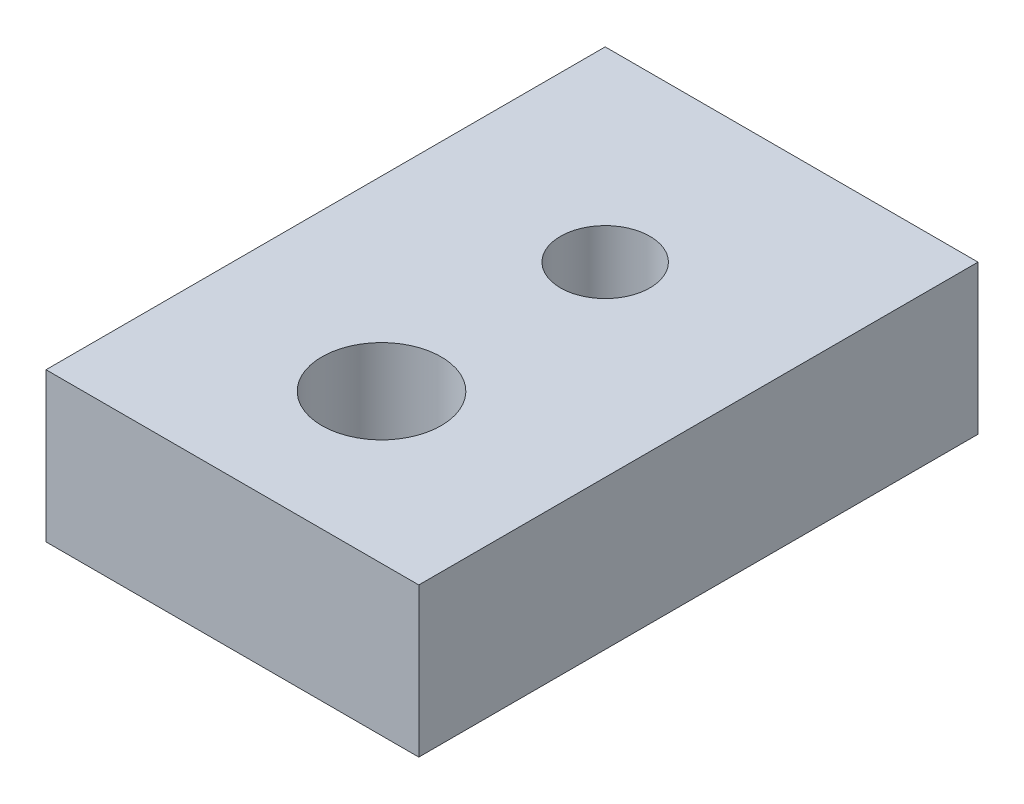
ISO-10303-21;
HEADER;
FILE_DESCRIPTION(('STEP AP214'),'2;1');
FILE_NAME('part.step','',(''),(''),'','','');
FILE_SCHEMA(('AUTOMOTIVE_DESIGN { 1 0 10303 214 1 1 1 1 }'));
ENDSEC;
DATA;
#1=APPLICATION_CONTEXT('core data for automotive mechanical design processes');
#2=APPLICATION_PROTOCOL_DEFINITION('international standard','automotive_design',2000,#1);
#3=PRODUCT_CONTEXT('',#1,'mechanical');
#4=PRODUCT('Part','Part','',(#3));
#5=PRODUCT_RELATED_PRODUCT_CATEGORY('part','',(#4));
#6=PRODUCT_DEFINITION_FORMATION('','',#4);
#7=PRODUCT_DEFINITION_CONTEXT('part definition',#1,'design');
#8=PRODUCT_DEFINITION('design','',#6,#7);
#9=PRODUCT_DEFINITION_SHAPE('','',#8);
#10=(LENGTH_UNIT() NAMED_UNIT(*) SI_UNIT(.MILLI.,.METRE.));
#11=(NAMED_UNIT(*) PLANE_ANGLE_UNIT() SI_UNIT($,.RADIAN.));
#12=(NAMED_UNIT(*) SI_UNIT($,.STERADIAN.) SOLID_ANGLE_UNIT());
#13=UNCERTAINTY_MEASURE_WITH_UNIT(LENGTH_MEASURE(1.E-05),#10,'distance_accuracy_value','');
#14=(GEOMETRIC_REPRESENTATION_CONTEXT(3) GLOBAL_UNCERTAINTY_ASSIGNED_CONTEXT((#13)) GLOBAL_UNIT_ASSIGNED_CONTEXT((#10,
#11,#12)) REPRESENTATION_CONTEXT('',''));
#15=CARTESIAN_POINT('',(0.,0.,0.));
#16=DIRECTION('',(0.,0.,1.));
#17=DIRECTION('',(1.,0.,0.));
#18=AXIS2_PLACEMENT_3D('',#15,#16,#17);
#19=CARTESIAN_POINT('',(0.,20.,0.));
#20=DIRECTION('',(0.,1.,0.));
#21=DIRECTION('',(0.,0.,1.));
#22=AXIS2_PLACEMENT_3D('',#19,#20,#21);
#23=PLANE('',#22);
#24=CARTESIAN_POINT('',(0.,20.,0.));
#25=DIRECTION('',(0.,1.,0.));
#26=DIRECTION('',(0.,0.,1.));
#27=AXIS2_PLACEMENT_3D('',#24,#25,#26);
#28=CIRCLE('',#27,6.);
#29=CARTESIAN_POINT('',(0.,20.,6.));
#30=VERTEX_POINT('',#29);
#31=EDGE_CURVE('E100',#30,#30,#28,.T.);
#32=ORIENTED_EDGE('',*,*,#31,.F.);
#33=EDGE_LOOP('',(#32));
#34=FACE_BOUND('',#33,.T.);
#35=DIRECTION('',(0.,0.,1.));
#36=VECTOR('',#35,1.);
#37=CARTESIAN_POINT('',(-25.,20.,-25.));
#38=LINE('',#37,#36);
#39=CARTESIAN_POINT('',(-25.,20.,-25.));
#40=VERTEX_POINT('',#39);
#41=CARTESIAN_POINT('',(-25.,20.,50.));
#42=VERTEX_POINT('',#41);
#43=EDGE_CURVE('E85',#40,#42,#38,.T.);
#44=ORIENTED_EDGE('',*,*,#43,.T.);
#45=DIRECTION('',(1.,0.,0.));
#46=VECTOR('',#45,1.);
#47=CARTESIAN_POINT('',(-25.,20.,50.));
#48=LINE('',#47,#46);
#49=CARTESIAN_POINT('',(25.,20.,50.));
#50=VERTEX_POINT('',#49);
#51=EDGE_CURVE('E80',#42,#50,#48,.T.);
#52=ORIENTED_EDGE('',*,*,#51,.T.);
#53=DIRECTION('',(0.,0.,-1.));
#54=VECTOR('',#53,1.);
#55=CARTESIAN_POINT('',(25.,20.,-25.));
#56=LINE('',#55,#54);
#57=CARTESIAN_POINT('',(25.,20.,-25.));
#58=VERTEX_POINT('',#57);
#59=EDGE_CURVE('E83',#50,#58,#56,.T.);
#60=ORIENTED_EDGE('',*,*,#59,.T.);
#61=DIRECTION('',(-1.,0.,0.));
#62=VECTOR('',#61,1.);
#63=CARTESIAN_POINT('',(-25.,20.,-25.));
#64=LINE('',#63,#62);
#65=EDGE_CURVE('E50',#58,#40,#64,.T.);
#66=ORIENTED_EDGE('',*,*,#65,.T.);
#67=EDGE_LOOP('',(#44,#52,#60,#66));
#68=FACE_BOUND('',#67,.T.);
#69=CARTESIAN_POINT('',(0.,20.,30.));
#70=DIRECTION('',(0.,1.,0.));
#71=DIRECTION('',(0.,0.,1.));
#72=AXIS2_PLACEMENT_3D('',#69,#70,#71);
#73=CIRCLE('',#72,8.);
#74=CARTESIAN_POINT('',(0.,20.,38.));
#75=VERTEX_POINT('',#74);
#76=EDGE_CURVE('E115',#75,#75,#73,.T.);
#77=ORIENTED_EDGE('',*,*,#76,.F.);
#78=EDGE_LOOP('',(#77));
#79=FACE_BOUND('',#78,.T.);
#80=ADVANCED_FACE('F33',(#34,#68,#79),#23,.T.);
#81=CARTESIAN_POINT('',(0.,0.,0.));
#82=DIRECTION('',(0.,1.,0.));
#83=DIRECTION('',(0.,0.,1.));
#84=AXIS2_PLACEMENT_3D('',#81,#82,#83);
#85=PLANE('',#84);
#86=DIRECTION('',(0.,0.,1.));
#87=VECTOR('',#86,1.);
#88=CARTESIAN_POINT('',(-25.,0.,-25.));
#89=LINE('',#88,#87);
#90=CARTESIAN_POINT('',(-25.,0.,-25.));
#91=VERTEX_POINT('',#90);
#92=CARTESIAN_POINT('',(-25.,0.,50.));
#93=VERTEX_POINT('',#92);
#94=EDGE_CURVE('E97',#91,#93,#89,.T.);
#95=ORIENTED_EDGE('',*,*,#94,.F.);
#96=DIRECTION('',(-1.,0.,0.));
#97=VECTOR('',#96,1.);
#98=CARTESIAN_POINT('',(-25.,0.,-25.));
#99=LINE('',#98,#97);
#100=CARTESIAN_POINT('',(25.,0.,-25.));
#101=VERTEX_POINT('',#100);
#102=EDGE_CURVE('E73',#101,#91,#99,.T.);
#103=ORIENTED_EDGE('',*,*,#102,.F.);
#104=DIRECTION('',(0.,0.,-1.));
#105=VECTOR('',#104,1.);
#106=CARTESIAN_POINT('',(25.,0.,-25.));
#107=LINE('',#106,#105);
#108=CARTESIAN_POINT('',(25.,0.,50.));
#109=VERTEX_POINT('',#108);
#110=EDGE_CURVE('E67',#109,#101,#107,.T.);
#111=ORIENTED_EDGE('',*,*,#110,.F.);
#112=DIRECTION('',(1.,0.,0.));
#113=VECTOR('',#112,1.);
#114=CARTESIAN_POINT('',(-25.,0.,50.));
#115=LINE('',#114,#113);
#116=EDGE_CURVE('E89',#93,#109,#115,.T.);
#117=ORIENTED_EDGE('',*,*,#116,.F.);
#118=EDGE_LOOP('',(#95,#103,#111,#117));
#119=FACE_BOUND('',#118,.T.);
#120=CARTESIAN_POINT('',(0.,0.,0.));
#121=DIRECTION('',(0.,1.,0.));
#122=DIRECTION('',(0.,0.,1.));
#123=AXIS2_PLACEMENT_3D('',#120,#121,#122);
#124=CIRCLE('',#123,6.);
#125=CARTESIAN_POINT('',(0.,0.,6.));
#126=VERTEX_POINT('',#125);
#127=EDGE_CURVE('E112',#126,#126,#124,.T.);
#128=ORIENTED_EDGE('',*,*,#127,.T.);
#129=EDGE_LOOP('',(#128));
#130=FACE_BOUND('',#129,.T.);
#131=CARTESIAN_POINT('',(0.,0.,30.));
#132=DIRECTION('',(0.,1.,0.));
#133=DIRECTION('',(0.,0.,1.));
#134=AXIS2_PLACEMENT_3D('',#131,#132,#133);
#135=CIRCLE('',#134,8.);
#136=CARTESIAN_POINT('',(0.,0.,38.));
#137=VERTEX_POINT('',#136);
#138=EDGE_CURVE('E118',#137,#137,#135,.T.);
#139=ORIENTED_EDGE('',*,*,#138,.T.);
#140=EDGE_LOOP('',(#139));
#141=FACE_BOUND('',#140,.T.);
#142=ADVANCED_FACE('F108',(#119,#130,#141),#85,.F.);
#143=CARTESIAN_POINT('',(-25.,20.,-25.));
#144=DIRECTION('',(1.,0.,0.));
#145=DIRECTION('',(0.,0.,-1.));
#146=AXIS2_PLACEMENT_3D('',#143,#144,#145);
#147=PLANE('',#146);
#148=ORIENTED_EDGE('',*,*,#94,.T.);
#149=DIRECTION('',(0.,-1.,0.));
#150=VECTOR('',#149,1.);
#151=CARTESIAN_POINT('',(-25.,20.,50.));
#152=LINE('',#151,#150);
#153=EDGE_CURVE('E11',#42,#93,#152,.T.);
#154=ORIENTED_EDGE('',*,*,#153,.F.);
#155=ORIENTED_EDGE('',*,*,#43,.F.);
#156=DIRECTION('',(0.,-1.,0.));
#157=VECTOR('',#156,1.);
#158=CARTESIAN_POINT('',(-25.,20.,-25.));
#159=LINE('',#158,#157);
#160=EDGE_CURVE('E93',#40,#91,#159,.T.);
#161=ORIENTED_EDGE('',*,*,#160,.T.);
#162=EDGE_LOOP('',(#148,#154,#155,#161));
#163=FACE_BOUND('',#162,.T.);
#164=ADVANCED_FACE('F35',(#163),#147,.F.);
#165=CARTESIAN_POINT('',(-25.,20.,50.));
#166=DIRECTION('',(0.,0.,-1.));
#167=DIRECTION('',(-1.,0.,0.));
#168=AXIS2_PLACEMENT_3D('',#165,#166,#167);
#169=PLANE('',#168);
#170=ORIENTED_EDGE('',*,*,#116,.T.);
#171=DIRECTION('',(0.,-1.,0.));
#172=VECTOR('',#171,1.);
#173=CARTESIAN_POINT('',(25.,20.,50.));
#174=LINE('',#173,#172);
#175=EDGE_CURVE('E42',#50,#109,#174,.T.);
#176=ORIENTED_EDGE('',*,*,#175,.F.);
#177=ORIENTED_EDGE('',*,*,#51,.F.);
#178=ORIENTED_EDGE('',*,*,#153,.T.);
#179=EDGE_LOOP('',(#170,#176,#177,#178));
#180=FACE_BOUND('',#179,.T.);
#181=ADVANCED_FACE('F88',(#180),#169,.F.);
#182=CARTESIAN_POINT('',(25.,20.,-25.));
#183=DIRECTION('',(-1.,0.,0.));
#184=DIRECTION('',(0.,0.,1.));
#185=AXIS2_PLACEMENT_3D('',#182,#183,#184);
#186=PLANE('',#185);
#187=ORIENTED_EDGE('',*,*,#110,.T.);
#188=DIRECTION('',(0.,-1.,0.));
#189=VECTOR('',#188,1.);
#190=CARTESIAN_POINT('',(25.,20.,-25.));
#191=LINE('',#190,#189);
#192=EDGE_CURVE('E90',#58,#101,#191,.T.);
#193=ORIENTED_EDGE('',*,*,#192,.F.);
#194=ORIENTED_EDGE('',*,*,#59,.F.);
#195=ORIENTED_EDGE('',*,*,#175,.T.);
#196=EDGE_LOOP('',(#187,#193,#194,#195));
#197=FACE_BOUND('',#196,.T.);
#198=ADVANCED_FACE('F91',(#197),#186,.F.);
#199=CARTESIAN_POINT('',(-25.,20.,-25.));
#200=DIRECTION('',(0.,0.,1.));
#201=DIRECTION('',(1.,0.,0.));
#202=AXIS2_PLACEMENT_3D('',#199,#200,#201);
#203=PLANE('',#202);
#204=ORIENTED_EDGE('',*,*,#102,.T.);
#205=ORIENTED_EDGE('',*,*,#160,.F.);
#206=ORIENTED_EDGE('',*,*,#65,.F.);
#207=ORIENTED_EDGE('',*,*,#192,.T.);
#208=EDGE_LOOP('',(#204,#205,#206,#207));
#209=FACE_BOUND('',#208,.T.);
#210=ADVANCED_FACE('F105',(#209),#203,.F.);
#211=CARTESIAN_POINT('',(0.,20.,0.));
#212=DIRECTION('',(0.,-1.,0.));
#213=DIRECTION('',(0.,0.,-1.));
#214=AXIS2_PLACEMENT_3D('',#211,#212,#213);
#215=CYLINDRICAL_SURFACE('',#214,6.);
#216=ORIENTED_EDGE('',*,*,#31,.T.);
#217=EDGE_LOOP('',(#216));
#218=FACE_BOUND('',#217,.T.);
#219=ORIENTED_EDGE('',*,*,#127,.F.);
#220=EDGE_LOOP('',(#219));
#221=FACE_BOUND('',#220,.T.);
#222=ADVANCED_FACE('F135',(#218,#221),#215,.F.);
#223=CARTESIAN_POINT('',(0.,20.,30.));
#224=DIRECTION('',(0.,-1.,0.));
#225=DIRECTION('',(0.,0.,-1.));
#226=AXIS2_PLACEMENT_3D('',#223,#224,#225);
#227=CYLINDRICAL_SURFACE('',#226,8.);
#228=ORIENTED_EDGE('',*,*,#76,.T.);
#229=EDGE_LOOP('',(#228));
#230=FACE_BOUND('',#229,.T.);
#231=ORIENTED_EDGE('',*,*,#138,.F.);
#232=EDGE_LOOP('',(#231));
#233=FACE_BOUND('',#232,.T.);
#234=ADVANCED_FACE('F124',(#230,#233),#227,.F.);
#235=CLOSED_SHELL('',(#80,#142,#164,#181,#198,#210,#222,#234));
#236=MANIFOLD_SOLID_BREP('B2',#235);
#237=ADVANCED_BREP_SHAPE_REPRESENTATION('',(#18,#236),#14);
#238=SHAPE_DEFINITION_REPRESENTATION(#9,#237);
ENDSEC;
END-ISO-10303-21;
